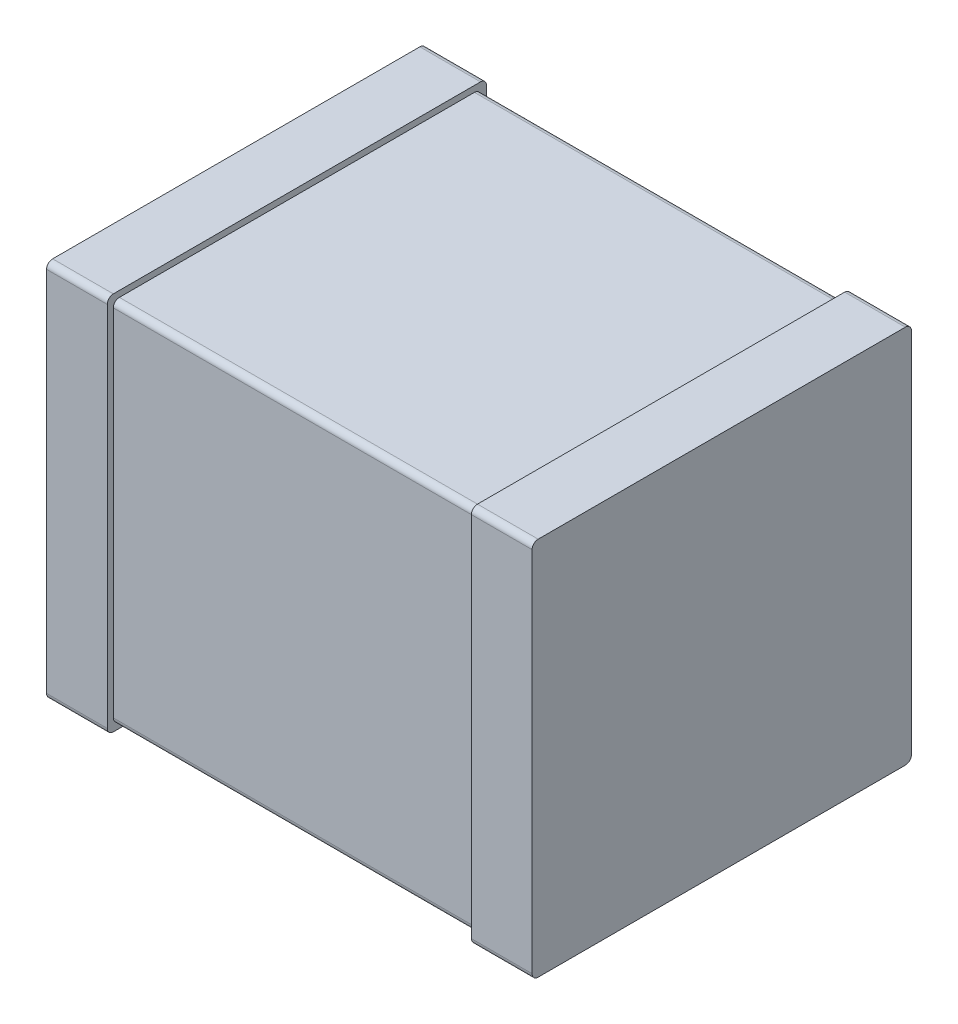
ISO-10303-21;
HEADER;
FILE_DESCRIPTION(('STEP AP214'),'2;1');
FILE_NAME('part.step','',(''),(''),'','','');
FILE_SCHEMA(('AUTOMOTIVE_DESIGN { 1 0 10303 214 1 1 1 1 }'));
ENDSEC;
DATA;
#1=APPLICATION_CONTEXT('core data for automotive mechanical design processes');
#2=APPLICATION_PROTOCOL_DEFINITION('international standard','automotive_design',2000,#1);
#3=PRODUCT_CONTEXT('',#1,'mechanical');
#4=PRODUCT('Part','Part','',(#3));
#5=PRODUCT_RELATED_PRODUCT_CATEGORY('part','',(#4));
#6=PRODUCT_DEFINITION_FORMATION('','',#4);
#7=PRODUCT_DEFINITION_CONTEXT('part definition',#1,'design');
#8=PRODUCT_DEFINITION('design','',#6,#7);
#9=PRODUCT_DEFINITION_SHAPE('','',#8);
#10=(LENGTH_UNIT() NAMED_UNIT(*) SI_UNIT(.MILLI.,.METRE.));
#11=(NAMED_UNIT(*) PLANE_ANGLE_UNIT() SI_UNIT($,.RADIAN.));
#12=(NAMED_UNIT(*) SI_UNIT($,.STERADIAN.) SOLID_ANGLE_UNIT());
#13=UNCERTAINTY_MEASURE_WITH_UNIT(LENGTH_MEASURE(1.E-05),#10,'distance_accuracy_value','');
#14=(GEOMETRIC_REPRESENTATION_CONTEXT(3) GLOBAL_UNCERTAINTY_ASSIGNED_CONTEXT((#13)) GLOBAL_UNIT_ASSIGNED_CONTEXT((#10,
#11,#12)) REPRESENTATION_CONTEXT('',''));
#15=CARTESIAN_POINT('',(0.,0.,0.));
#16=DIRECTION('',(0.,0.,1.));
#17=DIRECTION('',(1.,0.,0.));
#18=AXIS2_PLACEMENT_3D('',#15,#16,#17);
#19=CARTESIAN_POINT('',(1.6,-1.25,0.));
#20=DIRECTION('',(1.,0.,0.));
#21=DIRECTION('',(0.,1.,0.));
#22=AXIS2_PLACEMENT_3D('',#19,#20,#21);
#23=PLANE('',#22);
#24=DIRECTION('',(0.,0.,1.));
#25=VECTOR('',#24,1.);
#26=CARTESIAN_POINT('',(1.6,-1.25,0.));
#27=LINE('',#26,#25);
#28=CARTESIAN_POINT('',(1.6,-1.25,0.04));
#29=VERTEX_POINT('',#28);
#30=CARTESIAN_POINT('',(1.6,-1.25,2.46));
#31=VERTEX_POINT('',#30);
#32=EDGE_CURVE('E305',#29,#31,#27,.T.);
#33=ORIENTED_EDGE('',*,*,#32,.F.);
#34=CARTESIAN_POINT('',(1.6,-1.21,0.04));
#35=DIRECTION('',(1.,0.,0.));
#36=DIRECTION('',(0.,0.,1.));
#37=AXIS2_PLACEMENT_3D('',#34,#35,#36);
#38=CIRCLE('',#37,0.04);
#39=CARTESIAN_POINT('',(1.6,-1.21,0.));
#40=VERTEX_POINT('',#39);
#41=EDGE_CURVE('E290',#29,#40,#38,.T.);
#42=ORIENTED_EDGE('',*,*,#41,.T.);
#43=DIRECTION('',(0.,1.,0.));
#44=VECTOR('',#43,1.);
#45=CARTESIAN_POINT('',(1.6,-1.25,0.));
#46=LINE('',#45,#44);
#47=CARTESIAN_POINT('',(1.6,1.21,0.));
#48=VERTEX_POINT('',#47);
#49=EDGE_CURVE('E226',#40,#48,#46,.T.);
#50=ORIENTED_EDGE('',*,*,#49,.T.);
#51=CARTESIAN_POINT('',(1.6,1.21,0.04));
#52=DIRECTION('',(-1.,0.,0.));
#53=DIRECTION('',(0.,0.,1.));
#54=AXIS2_PLACEMENT_3D('',#51,#52,#53);
#55=CIRCLE('',#54,0.04);
#56=CARTESIAN_POINT('',(1.6,1.25,0.04));
#57=VERTEX_POINT('',#56);
#58=EDGE_CURVE('E209',#57,#48,#55,.T.);
#59=ORIENTED_EDGE('',*,*,#58,.F.);
#60=DIRECTION('',(0.,0.,1.));
#61=VECTOR('',#60,1.);
#62=CARTESIAN_POINT('',(1.6,1.25,0.));
#63=LINE('',#62,#61);
#64=CARTESIAN_POINT('',(1.6,1.25,2.46));
#65=VERTEX_POINT('',#64);
#66=EDGE_CURVE('E10',#57,#65,#63,.T.);
#67=ORIENTED_EDGE('',*,*,#66,.T.);
#68=CARTESIAN_POINT('',(1.6,1.21,2.46));
#69=DIRECTION('',(1.,0.,0.));
#70=DIRECTION('',(0.,0.,1.));
#71=AXIS2_PLACEMENT_3D('',#68,#69,#70);
#72=CIRCLE('',#71,0.04);
#73=CARTESIAN_POINT('',(1.6,1.21,2.5));
#74=VERTEX_POINT('',#73);
#75=EDGE_CURVE('E201',#65,#74,#72,.T.);
#76=ORIENTED_EDGE('',*,*,#75,.T.);
#77=DIRECTION('',(0.,1.,0.));
#78=VECTOR('',#77,1.);
#79=CARTESIAN_POINT('',(1.6,-1.25,2.5));
#80=LINE('',#79,#78);
#81=CARTESIAN_POINT('',(1.6,-1.21,2.5));
#82=VERTEX_POINT('',#81);
#83=EDGE_CURVE('E205',#82,#74,#80,.T.);
#84=ORIENTED_EDGE('',*,*,#83,.F.);
#85=CARTESIAN_POINT('',(1.6,-1.21,2.46));
#86=DIRECTION('',(-1.,0.,0.));
#87=DIRECTION('',(0.,0.,1.));
#88=AXIS2_PLACEMENT_3D('',#85,#86,#87);
#89=CIRCLE('',#88,0.04);
#90=EDGE_CURVE('E287',#31,#82,#89,.T.);
#91=ORIENTED_EDGE('',*,*,#90,.F.);
#92=EDGE_LOOP('',(#33,#42,#50,#59,#67,#76,#84,#91));
#93=FACE_BOUND('',#92,.T.);
#94=ADVANCED_FACE('F16',(#93),#23,.T.);
#95=CARTESIAN_POINT('',(1.2,1.25,0.));
#96=DIRECTION('',(0.,1.,0.));
#97=DIRECTION('',(1.,0.,0.));
#98=AXIS2_PLACEMENT_3D('',#95,#96,#97);
#99=PLANE('',#98);
#100=ORIENTED_EDGE('',*,*,#66,.F.);
#101=DIRECTION('',(1.,0.,0.));
#102=VECTOR('',#101,1.);
#103=CARTESIAN_POINT('',(1.2,1.25,0.04));
#104=LINE('',#103,#102);
#105=CARTESIAN_POINT('',(1.2,1.25,0.04));
#106=VERTEX_POINT('',#105);
#107=EDGE_CURVE('E220',#106,#57,#104,.T.);
#108=ORIENTED_EDGE('',*,*,#107,.F.);
#109=DIRECTION('',(0.,0.,1.));
#110=VECTOR('',#109,1.);
#111=CARTESIAN_POINT('',(1.2,1.25,0.));
#112=LINE('',#111,#110);
#113=CARTESIAN_POINT('',(1.2,1.25,2.46));
#114=VERTEX_POINT('',#113);
#115=EDGE_CURVE('E329',#106,#114,#112,.T.);
#116=ORIENTED_EDGE('',*,*,#115,.T.);
#117=DIRECTION('',(1.,0.,0.));
#118=VECTOR('',#117,1.);
#119=CARTESIAN_POINT('',(1.2,1.25,2.46));
#120=LINE('',#119,#118);
#121=EDGE_CURVE('E27',#114,#65,#120,.T.);
#122=ORIENTED_EDGE('',*,*,#121,.T.);
#123=EDGE_LOOP('',(#100,#108,#116,#122));
#124=FACE_BOUND('',#123,.T.);
#125=ADVANCED_FACE('F556',(#124),#99,.T.);
#126=CARTESIAN_POINT('',(1.2,1.21,2.46));
#127=DIRECTION('',(1.,0.,0.));
#128=DIRECTION('',(0.,1.,0.));
#129=AXIS2_PLACEMENT_3D('',#126,#127,#128);
#130=CYLINDRICAL_SURFACE('',#129,0.04);
#131=CARTESIAN_POINT('',(1.2,1.21,2.46));
#132=DIRECTION('',(1.,0.,0.));
#133=DIRECTION('',(0.,0.,1.));
#134=AXIS2_PLACEMENT_3D('',#131,#132,#133);
#135=CIRCLE('',#134,0.04);
#136=CARTESIAN_POINT('',(1.2,1.21,2.5));
#137=VERTEX_POINT('',#136);
#138=EDGE_CURVE('E215',#114,#137,#135,.T.);
#139=ORIENTED_EDGE('',*,*,#138,.T.);
#140=DIRECTION('',(1.,0.,0.));
#141=VECTOR('',#140,1.);
#142=CARTESIAN_POINT('',(1.2,1.21,2.5));
#143=LINE('',#142,#141);
#144=EDGE_CURVE('E212',#137,#74,#143,.T.);
#145=ORIENTED_EDGE('',*,*,#144,.T.);
#146=ORIENTED_EDGE('',*,*,#75,.F.);
#147=ORIENTED_EDGE('',*,*,#121,.F.);
#148=EDGE_LOOP('',(#139,#145,#146,#147));
#149=FACE_BOUND('',#148,.T.);
#150=ADVANCED_FACE('F213',(#149),#130,.T.);
#151=CARTESIAN_POINT('',(1.2,1.21,0.04));
#152=DIRECTION('',(1.,0.,0.));
#153=DIRECTION('',(0.,1.,0.));
#154=AXIS2_PLACEMENT_3D('',#151,#152,#153);
#155=CYLINDRICAL_SURFACE('',#154,0.04);
#156=ORIENTED_EDGE('',*,*,#107,.T.);
#157=ORIENTED_EDGE('',*,*,#58,.T.);
#158=DIRECTION('',(1.,0.,0.));
#159=VECTOR('',#158,1.);
#160=CARTESIAN_POINT('',(1.2,1.21,0.));
#161=LINE('',#160,#159);
#162=CARTESIAN_POINT('',(1.2,1.21,0.));
#163=VERTEX_POINT('',#162);
#164=EDGE_CURVE('E233',#163,#48,#161,.T.);
#165=ORIENTED_EDGE('',*,*,#164,.F.);
#166=CARTESIAN_POINT('',(1.2,1.21,0.04));
#167=DIRECTION('',(-1.,0.,0.));
#168=DIRECTION('',(0.,0.,1.));
#169=AXIS2_PLACEMENT_3D('',#166,#167,#168);
#170=CIRCLE('',#169,0.04);
#171=EDGE_CURVE('E324',#106,#163,#170,.T.);
#172=ORIENTED_EDGE('',*,*,#171,.F.);
#173=EDGE_LOOP('',(#156,#157,#165,#172));
#174=FACE_BOUND('',#173,.T.);
#175=ADVANCED_FACE('F579',(#174),#155,.T.);
#176=CARTESIAN_POINT('',(1.2,-1.25,2.5));
#177=DIRECTION('',(0.,0.,1.));
#178=DIRECTION('',(1.,0.,0.));
#179=AXIS2_PLACEMENT_3D('',#176,#177,#178);
#180=PLANE('',#179);
#181=DIRECTION('',(0.,1.,0.));
#182=VECTOR('',#181,1.);
#183=CARTESIAN_POINT('',(1.2,-1.25,2.5));
#184=LINE('',#183,#182);
#185=CARTESIAN_POINT('',(1.2,-1.21,2.5));
#186=VERTEX_POINT('',#185);
#187=EDGE_CURVE('E400',#186,#137,#184,.T.);
#188=ORIENTED_EDGE('',*,*,#187,.F.);
#189=DIRECTION('',(1.,0.,0.));
#190=VECTOR('',#189,1.);
#191=CARTESIAN_POINT('',(1.2,-1.21,2.5));
#192=LINE('',#191,#190);
#193=EDGE_CURVE('E223',#186,#82,#192,.T.);
#194=ORIENTED_EDGE('',*,*,#193,.T.);
#195=ORIENTED_EDGE('',*,*,#83,.T.);
#196=ORIENTED_EDGE('',*,*,#144,.F.);
#197=EDGE_LOOP('',(#188,#194,#195,#196));
#198=FACE_BOUND('',#197,.T.);
#199=ADVANCED_FACE('F222',(#198),#180,.T.);
#200=CARTESIAN_POINT('',(1.2,-1.25,0.));
#201=DIRECTION('',(0.,0.,1.));
#202=DIRECTION('',(1.,0.,0.));
#203=AXIS2_PLACEMENT_3D('',#200,#201,#202);
#204=PLANE('',#203);
#205=ORIENTED_EDGE('',*,*,#164,.T.);
#206=ORIENTED_EDGE('',*,*,#49,.F.);
#207=DIRECTION('',(1.,0.,0.));
#208=VECTOR('',#207,1.);
#209=CARTESIAN_POINT('',(1.2,-1.21,0.));
#210=LINE('',#209,#208);
#211=CARTESIAN_POINT('',(1.2,-1.21,0.));
#212=VERTEX_POINT('',#211);
#213=EDGE_CURVE('E308',#212,#40,#210,.T.);
#214=ORIENTED_EDGE('',*,*,#213,.F.);
#215=DIRECTION('',(0.,1.,0.));
#216=VECTOR('',#215,1.);
#217=CARTESIAN_POINT('',(1.2,-1.25,0.));
#218=LINE('',#217,#216);
#219=EDGE_CURVE('E328',#212,#163,#218,.T.);
#220=ORIENTED_EDGE('',*,*,#219,.T.);
#221=EDGE_LOOP('',(#205,#206,#214,#220));
#222=FACE_BOUND('',#221,.T.);
#223=ADVANCED_FACE('F578',(#222),#204,.F.);
#224=CARTESIAN_POINT('',(1.2,-1.21,2.46));
#225=DIRECTION('',(1.,0.,0.));
#226=DIRECTION('',(0.,-1.,0.));
#227=AXIS2_PLACEMENT_3D('',#224,#225,#226);
#228=CYLINDRICAL_SURFACE('',#227,0.04);
#229=DIRECTION('',(1.,0.,0.));
#230=VECTOR('',#229,1.);
#231=CARTESIAN_POINT('',(1.2,-1.25,2.46));
#232=LINE('',#231,#230);
#233=CARTESIAN_POINT('',(1.2,-1.25,2.46));
#234=VERTEX_POINT('',#233);
#235=EDGE_CURVE('E251',#234,#31,#232,.T.);
#236=ORIENTED_EDGE('',*,*,#235,.T.);
#237=ORIENTED_EDGE('',*,*,#90,.T.);
#238=ORIENTED_EDGE('',*,*,#193,.F.);
#239=CARTESIAN_POINT('',(1.2,-1.21,2.46));
#240=DIRECTION('',(-1.,0.,0.));
#241=DIRECTION('',(0.,0.,1.));
#242=AXIS2_PLACEMENT_3D('',#239,#240,#241);
#243=CIRCLE('',#242,0.04);
#244=EDGE_CURVE('E394',#234,#186,#243,.T.);
#245=ORIENTED_EDGE('',*,*,#244,.F.);
#246=EDGE_LOOP('',(#236,#237,#238,#245));
#247=FACE_BOUND('',#246,.T.);
#248=ADVANCED_FACE('F630',(#247),#228,.T.);
#249=CARTESIAN_POINT('',(1.2,-1.21,0.04));
#250=DIRECTION('',(1.,0.,0.));
#251=DIRECTION('',(0.,-1.,0.));
#252=AXIS2_PLACEMENT_3D('',#249,#250,#251);
#253=CYLINDRICAL_SURFACE('',#252,0.04);
#254=CARTESIAN_POINT('',(1.2,-1.21,0.04));
#255=DIRECTION('',(1.,0.,0.));
#256=DIRECTION('',(0.,0.,1.));
#257=AXIS2_PLACEMENT_3D('',#254,#255,#256);
#258=CIRCLE('',#257,0.04);
#259=CARTESIAN_POINT('',(1.2,-1.25,0.04));
#260=VERTEX_POINT('',#259);
#261=EDGE_CURVE('E252',#260,#212,#258,.T.);
#262=ORIENTED_EDGE('',*,*,#261,.T.);
#263=ORIENTED_EDGE('',*,*,#213,.T.);
#264=ORIENTED_EDGE('',*,*,#41,.F.);
#265=DIRECTION('',(1.,0.,0.));
#266=VECTOR('',#265,1.);
#267=CARTESIAN_POINT('',(1.2,-1.25,0.04));
#268=LINE('',#267,#266);
#269=EDGE_CURVE('E301',#260,#29,#268,.T.);
#270=ORIENTED_EDGE('',*,*,#269,.F.);
#271=EDGE_LOOP('',(#262,#263,#264,#270));
#272=FACE_BOUND('',#271,.T.);
#273=ADVANCED_FACE('F600',(#272),#253,.T.);
#274=CARTESIAN_POINT('',(1.2,-1.25,0.));
#275=DIRECTION('',(0.,1.,0.));
#276=DIRECTION('',(1.,0.,0.));
#277=AXIS2_PLACEMENT_3D('',#274,#275,#276);
#278=PLANE('',#277);
#279=ORIENTED_EDGE('',*,*,#235,.F.);
#280=DIRECTION('',(0.,0.,1.));
#281=VECTOR('',#280,1.);
#282=CARTESIAN_POINT('',(1.2,-1.25,0.));
#283=LINE('',#282,#281);
#284=EDGE_CURVE('E247',#260,#234,#283,.T.);
#285=ORIENTED_EDGE('',*,*,#284,.F.);
#286=ORIENTED_EDGE('',*,*,#269,.T.);
#287=ORIENTED_EDGE('',*,*,#32,.T.);
#288=EDGE_LOOP('',(#279,#285,#286,#287));
#289=FACE_BOUND('',#288,.T.);
#290=ADVANCED_FACE('F595',(#289),#278,.F.);
#291=CARTESIAN_POINT('',(1.2,-1.25,0.));
#292=DIRECTION('',(1.,0.,0.));
#293=DIRECTION('',(0.,1.,0.));
#294=AXIS2_PLACEMENT_3D('',#291,#292,#293);
#295=PLANE('',#294);
#296=DIRECTION('',(0.,1.,0.));
#297=VECTOR('',#296,1.);
#298=CARTESIAN_POINT('',(1.2,-1.21,0.04));
#299=LINE('',#298,#297);
#300=CARTESIAN_POINT('',(1.2,-1.17,0.04));
#301=VERTEX_POINT('',#300);
#302=CARTESIAN_POINT('',(1.2,1.17,0.04));
#303=VERTEX_POINT('',#302);
#304=EDGE_CURVE('E357',#301,#303,#299,.T.);
#305=ORIENTED_EDGE('',*,*,#304,.T.);
#306=CARTESIAN_POINT('',(1.2,1.17,0.08));
#307=DIRECTION('',(-1.,0.,0.));
#308=DIRECTION('',(0.,0.,1.));
#309=AXIS2_PLACEMENT_3D('',#306,#307,#308);
#310=CIRCLE('',#309,0.04);
#311=CARTESIAN_POINT('',(1.2,1.21,0.08));
#312=VERTEX_POINT('',#311);
#313=EDGE_CURVE('E272',#312,#303,#310,.T.);
#314=ORIENTED_EDGE('',*,*,#313,.F.);
#315=DIRECTION('',(0.,0.,1.));
#316=VECTOR('',#315,1.);
#317=CARTESIAN_POINT('',(1.2,1.21,0.04));
#318=LINE('',#317,#316);
#319=CARTESIAN_POINT('',(1.2,1.21,2.42));
#320=VERTEX_POINT('',#319);
#321=EDGE_CURVE('E267',#312,#320,#318,.T.);
#322=ORIENTED_EDGE('',*,*,#321,.T.);
#323=CARTESIAN_POINT('',(1.2,1.17,2.42));
#324=DIRECTION('',(1.,0.,0.));
#325=DIRECTION('',(0.,0.,1.));
#326=AXIS2_PLACEMENT_3D('',#323,#324,#325);
#327=CIRCLE('',#326,0.04);
#328=CARTESIAN_POINT('',(1.2,1.17,2.46));
#329=VERTEX_POINT('',#328);
#330=EDGE_CURVE('E276',#320,#329,#327,.T.);
#331=ORIENTED_EDGE('',*,*,#330,.T.);
#332=DIRECTION('',(0.,1.,0.));
#333=VECTOR('',#332,1.);
#334=CARTESIAN_POINT('',(1.2,-1.21,2.46));
#335=LINE('',#334,#333);
#336=CARTESIAN_POINT('',(1.2,-1.17,2.46));
#337=VERTEX_POINT('',#336);
#338=EDGE_CURVE('E150',#337,#329,#335,.T.);
#339=ORIENTED_EDGE('',*,*,#338,.F.);
#340=CARTESIAN_POINT('',(1.2,-1.17,2.42));
#341=DIRECTION('',(-1.,0.,0.));
#342=DIRECTION('',(0.,0.,1.));
#343=AXIS2_PLACEMENT_3D('',#340,#341,#342);
#344=CIRCLE('',#343,0.04);
#345=CARTESIAN_POINT('',(1.2,-1.21,2.42));
#346=VERTEX_POINT('',#345);
#347=EDGE_CURVE('E135',#346,#337,#344,.T.);
#348=ORIENTED_EDGE('',*,*,#347,.F.);
#349=DIRECTION('',(0.,0.,1.));
#350=VECTOR('',#349,1.);
#351=CARTESIAN_POINT('',(1.2,-1.21,0.04));
#352=LINE('',#351,#350);
#353=CARTESIAN_POINT('',(1.2,-1.21,0.08));
#354=VERTEX_POINT('',#353);
#355=EDGE_CURVE('E391',#354,#346,#352,.T.);
#356=ORIENTED_EDGE('',*,*,#355,.F.);
#357=CARTESIAN_POINT('',(1.2,-1.17,0.08));
#358=DIRECTION('',(1.,0.,0.));
#359=DIRECTION('',(0.,0.,1.));
#360=AXIS2_PLACEMENT_3D('',#357,#358,#359);
#361=CIRCLE('',#360,0.04);
#362=EDGE_CURVE('E379',#354,#301,#361,.T.);
#363=ORIENTED_EDGE('',*,*,#362,.T.);
#364=EDGE_LOOP('',(#305,#314,#322,#331,#339,#348,#356,#363));
#365=FACE_BOUND('',#364,.T.);
#366=ORIENTED_EDGE('',*,*,#244,.T.);
#367=ORIENTED_EDGE('',*,*,#187,.T.);
#368=ORIENTED_EDGE('',*,*,#138,.F.);
#369=ORIENTED_EDGE('',*,*,#115,.F.);
#370=ORIENTED_EDGE('',*,*,#171,.T.);
#371=ORIENTED_EDGE('',*,*,#219,.F.);
#372=ORIENTED_EDGE('',*,*,#261,.F.);
#373=ORIENTED_EDGE('',*,*,#284,.T.);
#374=EDGE_LOOP('',(#366,#367,#368,#369,#370,#371,#372,#373));
#375=FACE_BOUND('',#374,.T.);
#376=ADVANCED_FACE('F599',(#365,#375),#295,.F.);
#377=CARTESIAN_POINT('',(-1.2,-1.21,0.04));
#378=DIRECTION('',(0.,1.,0.));
#379=DIRECTION('',(1.,0.,0.));
#380=AXIS2_PLACEMENT_3D('',#377,#378,#379);
#381=PLANE('',#380);
#382=DIRECTION('',(1.,0.,0.));
#383=VECTOR('',#382,1.);
#384=CARTESIAN_POINT('',(-1.2,-1.21,2.42));
#385=LINE('',#384,#383);
#386=CARTESIAN_POINT('',(-1.2,-1.21,2.42));
#387=VERTEX_POINT('',#386);
#388=EDGE_CURVE('E244',#387,#346,#385,.T.);
#389=ORIENTED_EDGE('',*,*,#388,.F.);
#390=DIRECTION('',(0.,0.,1.));
#391=VECTOR('',#390,1.);
#392=CARTESIAN_POINT('',(-1.2,-1.21,0.04));
#393=LINE('',#392,#391);
#394=CARTESIAN_POINT('',(-1.2,-1.21,0.08));
#395=VERTEX_POINT('',#394);
#396=EDGE_CURVE('E20',#395,#387,#393,.T.);
#397=ORIENTED_EDGE('',*,*,#396,.F.);
#398=DIRECTION('',(1.,0.,0.));
#399=VECTOR('',#398,1.);
#400=CARTESIAN_POINT('',(-1.2,-1.21,0.08));
#401=LINE('',#400,#399);
#402=EDGE_CURVE('E358',#395,#354,#401,.T.);
#403=ORIENTED_EDGE('',*,*,#402,.T.);
#404=ORIENTED_EDGE('',*,*,#355,.T.);
#405=EDGE_LOOP('',(#389,#397,#403,#404));
#406=FACE_BOUND('',#405,.T.);
#407=ADVANCED_FACE('F610',(#406),#381,.F.);
#408=CARTESIAN_POINT('',(-1.2,-1.17,2.42));
#409=DIRECTION('',(1.,0.,0.));
#410=DIRECTION('',(0.,-1.,0.));
#411=AXIS2_PLACEMENT_3D('',#408,#409,#410);
#412=CYLINDRICAL_SURFACE('',#411,0.04);
#413=ORIENTED_EDGE('',*,*,#388,.T.);
#414=ORIENTED_EDGE('',*,*,#347,.T.);
#415=DIRECTION('',(1.,0.,0.));
#416=VECTOR('',#415,1.);
#417=CARTESIAN_POINT('',(-1.2,-1.17,2.46));
#418=LINE('',#417,#416);
#419=CARTESIAN_POINT('',(-1.2,-1.17,2.46));
#420=VERTEX_POINT('',#419);
#421=EDGE_CURVE('E273',#420,#337,#418,.T.);
#422=ORIENTED_EDGE('',*,*,#421,.F.);
#423=CARTESIAN_POINT('',(-1.2,-1.17,2.42));
#424=DIRECTION('',(-1.,0.,0.));
#425=DIRECTION('',(0.,0.,1.));
#426=AXIS2_PLACEMENT_3D('',#423,#424,#425);
#427=CIRCLE('',#426,0.04);
#428=EDGE_CURVE('E338',#387,#420,#427,.T.);
#429=ORIENTED_EDGE('',*,*,#428,.F.);
#430=EDGE_LOOP('',(#413,#414,#422,#429));
#431=FACE_BOUND('',#430,.T.);
#432=ADVANCED_FACE('F620',(#431),#412,.T.);
#433=CARTESIAN_POINT('',(-1.2,-1.21,2.46));
#434=DIRECTION('',(0.,0.,1.));
#435=DIRECTION('',(1.,0.,0.));
#436=AXIS2_PLACEMENT_3D('',#433,#434,#435);
#437=PLANE('',#436);
#438=DIRECTION('',(0.,1.,0.));
#439=VECTOR('',#438,1.);
#440=CARTESIAN_POINT('',(-1.2,-1.21,2.46));
#441=LINE('',#440,#439);
#442=CARTESIAN_POINT('',(-1.2,1.17,2.46));
#443=VERTEX_POINT('',#442);
#444=EDGE_CURVE('E342',#420,#443,#441,.T.);
#445=ORIENTED_EDGE('',*,*,#444,.F.);
#446=ORIENTED_EDGE('',*,*,#421,.T.);
#447=ORIENTED_EDGE('',*,*,#338,.T.);
#448=DIRECTION('',(1.,0.,0.));
#449=VECTOR('',#448,1.);
#450=CARTESIAN_POINT('',(-1.2,1.17,2.46));
#451=LINE('',#450,#449);
#452=EDGE_CURVE('E314',#443,#329,#451,.T.);
#453=ORIENTED_EDGE('',*,*,#452,.F.);
#454=EDGE_LOOP('',(#445,#446,#447,#453));
#455=FACE_BOUND('',#454,.T.);
#456=ADVANCED_FACE('F524',(#455),#437,.T.);
#457=CARTESIAN_POINT('',(-1.2,1.17,2.42));
#458=DIRECTION('',(1.,0.,0.));
#459=DIRECTION('',(0.,1.,0.));
#460=AXIS2_PLACEMENT_3D('',#457,#458,#459);
#461=CYLINDRICAL_SURFACE('',#460,0.04);
#462=CARTESIAN_POINT('',(-1.2,1.17,2.42));
#463=DIRECTION('',(1.,0.,0.));
#464=DIRECTION('',(0.,0.,1.));
#465=AXIS2_PLACEMENT_3D('',#462,#463,#464);
#466=CIRCLE('',#465,0.04);
#467=CARTESIAN_POINT('',(-1.2,1.21,2.42));
#468=VERTEX_POINT('',#467);
#469=EDGE_CURVE('E337',#468,#443,#466,.T.);
#470=ORIENTED_EDGE('',*,*,#469,.T.);
#471=ORIENTED_EDGE('',*,*,#452,.T.);
#472=ORIENTED_EDGE('',*,*,#330,.F.);
#473=DIRECTION('',(1.,0.,0.));
#474=VECTOR('',#473,1.);
#475=CARTESIAN_POINT('',(-1.2,1.21,2.42));
#476=LINE('',#475,#474);
#477=EDGE_CURVE('E271',#468,#320,#476,.T.);
#478=ORIENTED_EDGE('',*,*,#477,.F.);
#479=EDGE_LOOP('',(#470,#471,#472,#478));
#480=FACE_BOUND('',#479,.T.);
#481=ADVANCED_FACE('F527',(#480),#461,.T.);
#482=CARTESIAN_POINT('',(-1.2,1.21,0.04));
#483=DIRECTION('',(0.,1.,0.));
#484=DIRECTION('',(1.,0.,0.));
#485=AXIS2_PLACEMENT_3D('',#482,#483,#484);
#486=PLANE('',#485);
#487=ORIENTED_EDGE('',*,*,#321,.F.);
#488=DIRECTION('',(1.,0.,0.));
#489=VECTOR('',#488,1.);
#490=CARTESIAN_POINT('',(-1.2,1.21,0.08));
#491=LINE('',#490,#489);
#492=CARTESIAN_POINT('',(-1.2,1.21,0.08));
#493=VERTEX_POINT('',#492);
#494=EDGE_CURVE('E375',#493,#312,#491,.T.);
#495=ORIENTED_EDGE('',*,*,#494,.F.);
#496=DIRECTION('',(0.,0.,1.));
#497=VECTOR('',#496,1.);
#498=CARTESIAN_POINT('',(-1.2,1.21,0.04));
#499=LINE('',#498,#497);
#500=EDGE_CURVE('E332',#493,#468,#499,.T.);
#501=ORIENTED_EDGE('',*,*,#500,.T.);
#502=ORIENTED_EDGE('',*,*,#477,.T.);
#503=EDGE_LOOP('',(#487,#495,#501,#502));
#504=FACE_BOUND('',#503,.T.);
#505=ADVANCED_FACE('F531',(#504),#486,.T.);
#506=CARTESIAN_POINT('',(-1.2,1.17,0.08));
#507=DIRECTION('',(1.,0.,0.));
#508=DIRECTION('',(0.,1.,0.));
#509=AXIS2_PLACEMENT_3D('',#506,#507,#508);
#510=CYLINDRICAL_SURFACE('',#509,0.04);
#511=ORIENTED_EDGE('',*,*,#494,.T.);
#512=ORIENTED_EDGE('',*,*,#313,.T.);
#513=DIRECTION('',(1.,0.,0.));
#514=VECTOR('',#513,1.);
#515=CARTESIAN_POINT('',(-1.2,1.17,0.04));
#516=LINE('',#515,#514);
#517=CARTESIAN_POINT('',(-1.2,1.17,0.04));
#518=VERTEX_POINT('',#517);
#519=EDGE_CURVE('E353',#518,#303,#516,.T.);
#520=ORIENTED_EDGE('',*,*,#519,.F.);
#521=CARTESIAN_POINT('',(-1.2,1.17,0.08));
#522=DIRECTION('',(-1.,0.,0.));
#523=DIRECTION('',(0.,0.,1.));
#524=AXIS2_PLACEMENT_3D('',#521,#522,#523);
#525=CIRCLE('',#524,0.04);
#526=EDGE_CURVE('E336',#493,#518,#525,.T.);
#527=ORIENTED_EDGE('',*,*,#526,.F.);
#528=EDGE_LOOP('',(#511,#512,#520,#527));
#529=FACE_BOUND('',#528,.T.);
#530=ADVANCED_FACE('F537',(#529),#510,.T.);
#531=CARTESIAN_POINT('',(-1.2,-1.21,0.04));
#532=DIRECTION('',(0.,0.,1.));
#533=DIRECTION('',(1.,0.,0.));
#534=AXIS2_PLACEMENT_3D('',#531,#532,#533);
#535=PLANE('',#534);
#536=ORIENTED_EDGE('',*,*,#519,.T.);
#537=ORIENTED_EDGE('',*,*,#304,.F.);
#538=DIRECTION('',(1.,0.,0.));
#539=VECTOR('',#538,1.);
#540=CARTESIAN_POINT('',(-1.2,-1.17,0.04));
#541=LINE('',#540,#539);
#542=CARTESIAN_POINT('',(-1.2,-1.17,0.04));
#543=VERTEX_POINT('',#542);
#544=EDGE_CURVE('E421',#543,#301,#541,.T.);
#545=ORIENTED_EDGE('',*,*,#544,.F.);
#546=DIRECTION('',(0.,1.,0.));
#547=VECTOR('',#546,1.);
#548=CARTESIAN_POINT('',(-1.2,-1.21,0.04));
#549=LINE('',#548,#547);
#550=EDGE_CURVE('E425',#543,#518,#549,.T.);
#551=ORIENTED_EDGE('',*,*,#550,.T.);
#552=EDGE_LOOP('',(#536,#537,#545,#551));
#553=FACE_BOUND('',#552,.T.);
#554=ADVANCED_FACE('F541',(#553),#535,.F.);
#555=CARTESIAN_POINT('',(-1.2,-1.17,0.08));
#556=DIRECTION('',(1.,0.,0.));
#557=DIRECTION('',(0.,-1.,0.));
#558=AXIS2_PLACEMENT_3D('',#555,#556,#557);
#559=CYLINDRICAL_SURFACE('',#558,0.04);
#560=CARTESIAN_POINT('',(-1.2,-1.17,0.08));
#561=DIRECTION('',(1.,0.,0.));
#562=DIRECTION('',(0.,0.,1.));
#563=AXIS2_PLACEMENT_3D('',#560,#561,#562);
#564=CIRCLE('',#563,0.04);
#565=EDGE_CURVE('E262',#395,#543,#564,.T.);
#566=ORIENTED_EDGE('',*,*,#565,.T.);
#567=ORIENTED_EDGE('',*,*,#544,.T.);
#568=ORIENTED_EDGE('',*,*,#362,.F.);
#569=ORIENTED_EDGE('',*,*,#402,.F.);
#570=EDGE_LOOP('',(#566,#567,#568,#569));
#571=FACE_BOUND('',#570,.T.);
#572=ADVANCED_FACE('F18',(#571),#559,.T.);
#573=CARTESIAN_POINT('',(-1.2,-1.25,0.));
#574=DIRECTION('',(1.,0.,0.));
#575=DIRECTION('',(0.,1.,0.));
#576=AXIS2_PLACEMENT_3D('',#573,#574,#575);
#577=PLANE('',#576);
#578=ORIENTED_EDGE('',*,*,#565,.F.);
#579=ORIENTED_EDGE('',*,*,#396,.T.);
#580=ORIENTED_EDGE('',*,*,#428,.T.);
#581=ORIENTED_EDGE('',*,*,#444,.T.);
#582=ORIENTED_EDGE('',*,*,#469,.F.);
#583=ORIENTED_EDGE('',*,*,#500,.F.);
#584=ORIENTED_EDGE('',*,*,#526,.T.);
#585=ORIENTED_EDGE('',*,*,#550,.F.);
#586=EDGE_LOOP('',(#578,#579,#580,#581,#582,#583,#584,#585));
#587=FACE_BOUND('',#586,.T.);
#588=DIRECTION('',(0.,0.,1.));
#589=VECTOR('',#588,1.);
#590=CARTESIAN_POINT('',(-1.2,-1.25,0.));
#591=LINE('',#590,#589);
#592=CARTESIAN_POINT('',(-1.2,-1.25,0.04));
#593=VERTEX_POINT('',#592);
#594=CARTESIAN_POINT('',(-1.2,-1.25,2.46));
#595=VERTEX_POINT('',#594);
#596=EDGE_CURVE('E323',#593,#595,#591,.T.);
#597=ORIENTED_EDGE('',*,*,#596,.F.);
#598=CARTESIAN_POINT('',(-1.2,-1.21,0.04));
#599=DIRECTION('',(1.,0.,0.));
#600=DIRECTION('',(0.,0.,1.));
#601=AXIS2_PLACEMENT_3D('',#598,#599,#600);
#602=CIRCLE('',#601,0.04);
#603=CARTESIAN_POINT('',(-1.2,-1.21,0.));
#604=VERTEX_POINT('',#603);
#605=EDGE_CURVE('E291',#593,#604,#602,.T.);
#606=ORIENTED_EDGE('',*,*,#605,.T.);
#607=DIRECTION('',(0.,1.,0.));
#608=VECTOR('',#607,1.);
#609=CARTESIAN_POINT('',(-1.2,-1.25,0.));
#610=LINE('',#609,#608);
#611=CARTESIAN_POINT('',(-1.2,1.21,0.));
#612=VERTEX_POINT('',#611);
#613=EDGE_CURVE('E286',#604,#612,#610,.T.);
#614=ORIENTED_EDGE('',*,*,#613,.T.);
#615=CARTESIAN_POINT('',(-1.2,1.21,0.04));
#616=DIRECTION('',(-1.,0.,0.));
#617=DIRECTION('',(0.,0.,1.));
#618=AXIS2_PLACEMENT_3D('',#615,#616,#617);
#619=CIRCLE('',#618,0.04);
#620=CARTESIAN_POINT('',(-1.2,1.25,0.04));
#621=VERTEX_POINT('',#620);
#622=EDGE_CURVE('E257',#621,#612,#619,.T.);
#623=ORIENTED_EDGE('',*,*,#622,.F.);
#624=DIRECTION('',(0.,0.,1.));
#625=VECTOR('',#624,1.);
#626=CARTESIAN_POINT('',(-1.2,1.25,0.));
#627=LINE('',#626,#625);
#628=CARTESIAN_POINT('',(-1.2,1.25,2.46));
#629=VERTEX_POINT('',#628);
#630=EDGE_CURVE('E259',#621,#629,#627,.T.);
#631=ORIENTED_EDGE('',*,*,#630,.T.);
#632=CARTESIAN_POINT('',(-1.2,1.21,2.46));
#633=DIRECTION('',(1.,0.,0.));
#634=DIRECTION('',(0.,0.,1.));
#635=AXIS2_PLACEMENT_3D('',#632,#633,#634);
#636=CIRCLE('',#635,0.04);
#637=CARTESIAN_POINT('',(-1.2,1.21,2.5));
#638=VERTEX_POINT('',#637);
#639=EDGE_CURVE('E297',#629,#638,#636,.T.);
#640=ORIENTED_EDGE('',*,*,#639,.T.);
#641=DIRECTION('',(0.,1.,0.));
#642=VECTOR('',#641,1.);
#643=CARTESIAN_POINT('',(-1.2,-1.25,2.5));
#644=LINE('',#643,#642);
#645=CARTESIAN_POINT('',(-1.2,-1.21,2.5));
#646=VERTEX_POINT('',#645);
#647=EDGE_CURVE('E349',#646,#638,#644,.T.);
#648=ORIENTED_EDGE('',*,*,#647,.F.);
#649=CARTESIAN_POINT('',(-1.2,-1.21,2.46));
#650=DIRECTION('',(-1.,0.,0.));
#651=DIRECTION('',(0.,0.,1.));
#652=AXIS2_PLACEMENT_3D('',#649,#650,#651);
#653=CIRCLE('',#652,0.04);
#654=EDGE_CURVE('E295',#595,#646,#653,.T.);
#655=ORIENTED_EDGE('',*,*,#654,.F.);
#656=EDGE_LOOP('',(#597,#606,#614,#623,#631,#640,#648,#655));
#657=FACE_BOUND('',#656,.T.);
#658=ADVANCED_FACE('F443',(#587,#657),#577,.T.);
#659=CARTESIAN_POINT('',(-1.6,1.25,0.));
#660=DIRECTION('',(0.,1.,0.));
#661=DIRECTION('',(1.,0.,0.));
#662=AXIS2_PLACEMENT_3D('',#659,#660,#661);
#663=PLANE('',#662);
#664=ORIENTED_EDGE('',*,*,#630,.F.);
#665=DIRECTION('',(1.,0.,0.));
#666=VECTOR('',#665,1.);
#667=CARTESIAN_POINT('',(-1.6,1.25,0.04));
#668=LINE('',#667,#666);
#669=CARTESIAN_POINT('',(-1.6,1.25,0.04));
#670=VERTEX_POINT('',#669);
#671=EDGE_CURVE('E253',#670,#621,#668,.T.);
#672=ORIENTED_EDGE('',*,*,#671,.F.);
#673=DIRECTION('',(0.,0.,1.));
#674=VECTOR('',#673,1.);
#675=CARTESIAN_POINT('',(-1.6,1.25,0.));
#676=LINE('',#675,#674);
#677=CARTESIAN_POINT('',(-1.6,1.25,2.46));
#678=VERTEX_POINT('',#677);
#679=EDGE_CURVE('E401',#670,#678,#676,.T.);
#680=ORIENTED_EDGE('',*,*,#679,.T.);
#681=DIRECTION('',(1.,0.,0.));
#682=VECTOR('',#681,1.);
#683=CARTESIAN_POINT('',(-1.6,1.25,2.46));
#684=LINE('',#683,#682);
#685=EDGE_CURVE('E263',#678,#629,#684,.T.);
#686=ORIENTED_EDGE('',*,*,#685,.T.);
#687=EDGE_LOOP('',(#664,#672,#680,#686));
#688=FACE_BOUND('',#687,.T.);
#689=ADVANCED_FACE('F585',(#688),#663,.T.);
#690=CARTESIAN_POINT('',(-1.6,1.21,2.46));
#691=DIRECTION('',(1.,0.,0.));
#692=DIRECTION('',(0.,1.,0.));
#693=AXIS2_PLACEMENT_3D('',#690,#691,#692);
#694=CYLINDRICAL_SURFACE('',#693,0.04);
#695=CARTESIAN_POINT('',(-1.6,1.21,2.46));
#696=DIRECTION('',(1.,0.,0.));
#697=DIRECTION('',(0.,0.,1.));
#698=AXIS2_PLACEMENT_3D('',#695,#696,#697);
#699=CIRCLE('',#698,0.04);
#700=CARTESIAN_POINT('',(-1.6,1.21,2.5));
#701=VERTEX_POINT('',#700);
#702=EDGE_CURVE('E406',#678,#701,#699,.T.);
#703=ORIENTED_EDGE('',*,*,#702,.T.);
#704=DIRECTION('',(1.,0.,0.));
#705=VECTOR('',#704,1.);
#706=CARTESIAN_POINT('',(-1.6,1.21,2.5));
#707=LINE('',#706,#705);
#708=EDGE_CURVE('E258',#701,#638,#707,.T.);
#709=ORIENTED_EDGE('',*,*,#708,.T.);
#710=ORIENTED_EDGE('',*,*,#639,.F.);
#711=ORIENTED_EDGE('',*,*,#685,.F.);
#712=EDGE_LOOP('',(#703,#709,#710,#711));
#713=FACE_BOUND('',#712,.T.);
#714=ADVANCED_FACE('F449',(#713),#694,.T.);
#715=CARTESIAN_POINT('',(-1.6,1.21,0.04));
#716=DIRECTION('',(1.,0.,0.));
#717=DIRECTION('',(0.,1.,0.));
#718=AXIS2_PLACEMENT_3D('',#715,#716,#717);
#719=CYLINDRICAL_SURFACE('',#718,0.04);
#720=ORIENTED_EDGE('',*,*,#671,.T.);
#721=ORIENTED_EDGE('',*,*,#622,.T.);
#722=DIRECTION('',(1.,0.,0.));
#723=VECTOR('',#722,1.);
#724=CARTESIAN_POINT('',(-1.6,1.21,0.));
#725=LINE('',#724,#723);
#726=CARTESIAN_POINT('',(-1.6,1.21,0.));
#727=VERTEX_POINT('',#726);
#728=EDGE_CURVE('E282',#727,#612,#725,.T.);
#729=ORIENTED_EDGE('',*,*,#728,.F.);
#730=CARTESIAN_POINT('',(-1.6,1.21,0.04));
#731=DIRECTION('',(-1.,0.,0.));
#732=DIRECTION('',(0.,0.,1.));
#733=AXIS2_PLACEMENT_3D('',#730,#731,#732);
#734=CIRCLE('',#733,0.04);
#735=EDGE_CURVE('E405',#670,#727,#734,.T.);
#736=ORIENTED_EDGE('',*,*,#735,.F.);
#737=EDGE_LOOP('',(#720,#721,#729,#736));
#738=FACE_BOUND('',#737,.T.);
#739=ADVANCED_FACE('F649',(#738),#719,.T.);
#740=CARTESIAN_POINT('',(-1.6,-1.25,2.5));
#741=DIRECTION('',(0.,0.,1.));
#742=DIRECTION('',(1.,0.,0.));
#743=AXIS2_PLACEMENT_3D('',#740,#741,#742);
#744=PLANE('',#743);
#745=DIRECTION('',(0.,1.,0.));
#746=VECTOR('',#745,1.);
#747=CARTESIAN_POINT('',(-1.6,-1.25,2.5));
#748=LINE('',#747,#746);
#749=CARTESIAN_POINT('',(-1.6,-1.21,2.5));
#750=VERTEX_POINT('',#749);
#751=EDGE_CURVE('E368',#750,#701,#748,.T.);
#752=ORIENTED_EDGE('',*,*,#751,.F.);
#753=DIRECTION('',(1.,0.,0.));
#754=VECTOR('',#753,1.);
#755=CARTESIAN_POINT('',(-1.6,-1.21,2.5));
#756=LINE('',#755,#754);
#757=EDGE_CURVE('E237',#750,#646,#756,.T.);
#758=ORIENTED_EDGE('',*,*,#757,.T.);
#759=ORIENTED_EDGE('',*,*,#647,.T.);
#760=ORIENTED_EDGE('',*,*,#708,.F.);
#761=EDGE_LOOP('',(#752,#758,#759,#760));
#762=FACE_BOUND('',#761,.T.);
#763=ADVANCED_FACE('F438',(#762),#744,.T.);
#764=CARTESIAN_POINT('',(-1.6,-1.25,0.));
#765=DIRECTION('',(0.,0.,1.));
#766=DIRECTION('',(1.,0.,0.));
#767=AXIS2_PLACEMENT_3D('',#764,#765,#766);
#768=PLANE('',#767);
#769=ORIENTED_EDGE('',*,*,#728,.T.);
#770=ORIENTED_EDGE('',*,*,#613,.F.);
#771=DIRECTION('',(1.,0.,0.));
#772=VECTOR('',#771,1.);
#773=CARTESIAN_POINT('',(-1.6,-1.21,0.));
#774=LINE('',#773,#772);
#775=CARTESIAN_POINT('',(-1.6,-1.21,0.));
#776=VERTEX_POINT('',#775);
#777=EDGE_CURVE('E296',#776,#604,#774,.T.);
#778=ORIENTED_EDGE('',*,*,#777,.F.);
#779=DIRECTION('',(0.,1.,0.));
#780=VECTOR('',#779,1.);
#781=CARTESIAN_POINT('',(-1.6,-1.25,0.));
#782=LINE('',#781,#780);
#783=EDGE_CURVE('E281',#776,#727,#782,.T.);
#784=ORIENTED_EDGE('',*,*,#783,.T.);
#785=EDGE_LOOP('',(#769,#770,#778,#784));
#786=FACE_BOUND('',#785,.T.);
#787=ADVANCED_FACE('F698',(#786),#768,.F.);
#788=CARTESIAN_POINT('',(-1.6,-1.21,2.46));
#789=DIRECTION('',(1.,0.,0.));
#790=DIRECTION('',(0.,-1.,0.));
#791=AXIS2_PLACEMENT_3D('',#788,#789,#790);
#792=CYLINDRICAL_SURFACE('',#791,0.04);
#793=DIRECTION('',(1.,0.,0.));
#794=VECTOR('',#793,1.);
#795=CARTESIAN_POINT('',(-1.6,-1.25,2.46));
#796=LINE('',#795,#794);
#797=CARTESIAN_POINT('',(-1.6,-1.25,2.46));
#798=VERTEX_POINT('',#797);
#799=EDGE_CURVE('E239',#798,#595,#796,.T.);
#800=ORIENTED_EDGE('',*,*,#799,.T.);
#801=ORIENTED_EDGE('',*,*,#654,.T.);
#802=ORIENTED_EDGE('',*,*,#757,.F.);
#803=CARTESIAN_POINT('',(-1.6,-1.21,2.46));
#804=DIRECTION('',(-1.,0.,0.));
#805=DIRECTION('',(0.,0.,1.));
#806=AXIS2_PLACEMENT_3D('',#803,#804,#805);
#807=CIRCLE('',#806,0.04);
#808=EDGE_CURVE('E364',#798,#750,#807,.T.);
#809=ORIENTED_EDGE('',*,*,#808,.F.);
#810=EDGE_LOOP('',(#800,#801,#802,#809));
#811=FACE_BOUND('',#810,.T.);
#812=ADVANCED_FACE('F459',(#811),#792,.T.);
#813=CARTESIAN_POINT('',(-1.6,-1.21,0.04));
#814=DIRECTION('',(1.,0.,0.));
#815=DIRECTION('',(0.,-1.,0.));
#816=AXIS2_PLACEMENT_3D('',#813,#814,#815);
#817=CYLINDRICAL_SURFACE('',#816,0.04);
#818=CARTESIAN_POINT('',(-1.6,-1.21,0.04));
#819=DIRECTION('',(1.,0.,0.));
#820=DIRECTION('',(0.,0.,1.));
#821=AXIS2_PLACEMENT_3D('',#818,#819,#820);
#822=CIRCLE('',#821,0.04);
#823=CARTESIAN_POINT('',(-1.6,-1.25,0.04));
#824=VERTEX_POINT('',#823);
#825=EDGE_CURVE('E277',#824,#776,#822,.T.);
#826=ORIENTED_EDGE('',*,*,#825,.T.);
#827=ORIENTED_EDGE('',*,*,#777,.T.);
#828=ORIENTED_EDGE('',*,*,#605,.F.);
#829=DIRECTION('',(1.,0.,0.));
#830=VECTOR('',#829,1.);
#831=CARTESIAN_POINT('',(-1.6,-1.25,0.04));
#832=LINE('',#831,#830);
#833=EDGE_CURVE('E242',#824,#593,#832,.T.);
#834=ORIENTED_EDGE('',*,*,#833,.F.);
#835=EDGE_LOOP('',(#826,#827,#828,#834));
#836=FACE_BOUND('',#835,.T.);
#837=ADVANCED_FACE('F564',(#836),#817,.T.);
#838=CARTESIAN_POINT('',(-1.6,-1.25,0.));
#839=DIRECTION('',(0.,1.,0.));
#840=DIRECTION('',(1.,0.,0.));
#841=AXIS2_PLACEMENT_3D('',#838,#839,#840);
#842=PLANE('',#841);
#843=ORIENTED_EDGE('',*,*,#799,.F.);
#844=DIRECTION('',(0.,0.,1.));
#845=VECTOR('',#844,1.);
#846=CARTESIAN_POINT('',(-1.6,-1.25,0.));
#847=LINE('',#846,#845);
#848=EDGE_CURVE('E243',#824,#798,#847,.T.);
#849=ORIENTED_EDGE('',*,*,#848,.F.);
#850=ORIENTED_EDGE('',*,*,#833,.T.);
#851=ORIENTED_EDGE('',*,*,#596,.T.);
#852=EDGE_LOOP('',(#843,#849,#850,#851));
#853=FACE_BOUND('',#852,.T.);
#854=ADVANCED_FACE('F568',(#853),#842,.F.);
#855=CARTESIAN_POINT('',(-1.6,-1.25,0.));
#856=DIRECTION('',(1.,0.,0.));
#857=DIRECTION('',(0.,1.,0.));
#858=AXIS2_PLACEMENT_3D('',#855,#856,#857);
#859=PLANE('',#858);
#860=ORIENTED_EDGE('',*,*,#808,.T.);
#861=ORIENTED_EDGE('',*,*,#751,.T.);
#862=ORIENTED_EDGE('',*,*,#702,.F.);
#863=ORIENTED_EDGE('',*,*,#679,.F.);
#864=ORIENTED_EDGE('',*,*,#735,.T.);
#865=ORIENTED_EDGE('',*,*,#783,.F.);
#866=ORIENTED_EDGE('',*,*,#825,.F.);
#867=ORIENTED_EDGE('',*,*,#848,.T.);
#868=EDGE_LOOP('',(#860,#861,#862,#863,#864,#865,#866,#867));
#869=FACE_BOUND('',#868,.T.);
#870=ADVANCED_FACE('F453',(#869),#859,.F.);
#871=CLOSED_SHELL('',(#94,#125,#150,#175,#199,#223,#248,#273,#290,#376,#407,#432,#456,#481,#505,
#530,#554,#572,#658,#689,#714,#739,#763,#787,#812,#837,#854,#870));
#872=MANIFOLD_SOLID_BREP('B1',#871);
#873=ADVANCED_BREP_SHAPE_REPRESENTATION('',(#18,#872),#14);
#874=SHAPE_DEFINITION_REPRESENTATION(#9,#873);
ENDSEC;
END-ISO-10303-21;
